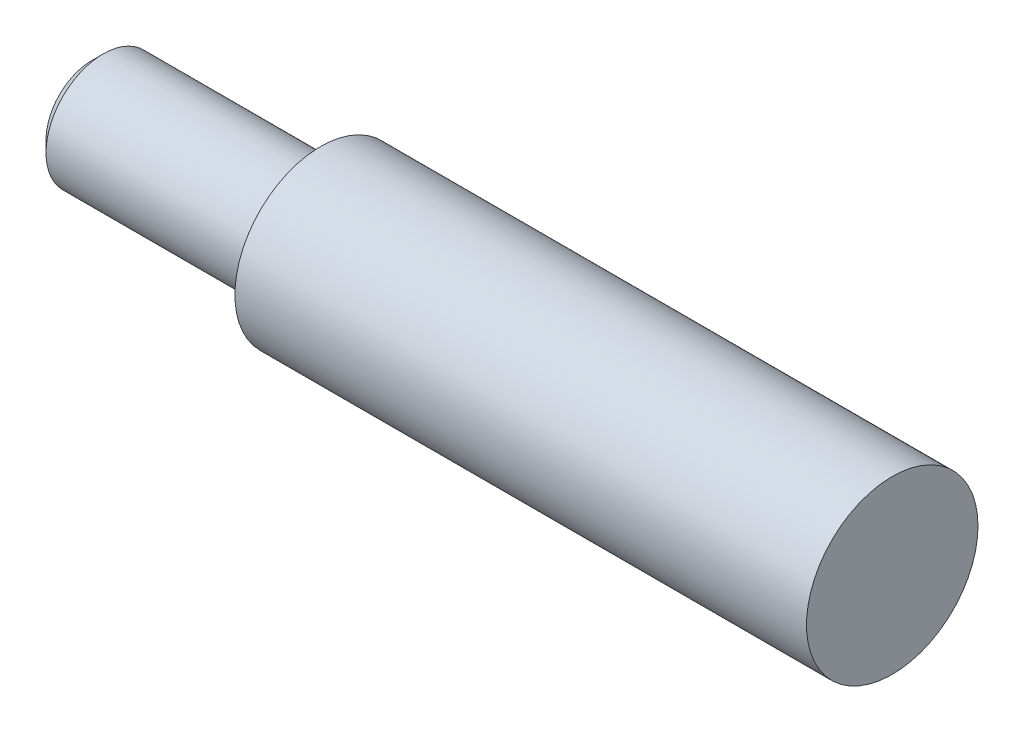
ISO-10303-21;
HEADER;
FILE_DESCRIPTION(('STEP AP214'),'2;1');
FILE_NAME('part.step','',(''),(''),'','','');
FILE_SCHEMA(('AUTOMOTIVE_DESIGN { 1 0 10303 214 1 1 1 1 }'));
ENDSEC;
DATA;
#1=APPLICATION_CONTEXT('core data for automotive mechanical design processes');
#2=APPLICATION_PROTOCOL_DEFINITION('international standard','automotive_design',2000,#1);
#3=PRODUCT_CONTEXT('',#1,'mechanical');
#4=PRODUCT('Part','Part','',(#3));
#5=PRODUCT_RELATED_PRODUCT_CATEGORY('part','',(#4));
#6=PRODUCT_DEFINITION_FORMATION('','',#4);
#7=PRODUCT_DEFINITION_CONTEXT('part definition',#1,'design');
#8=PRODUCT_DEFINITION('design','',#6,#7);
#9=PRODUCT_DEFINITION_SHAPE('','',#8);
#10=(LENGTH_UNIT() NAMED_UNIT(*) SI_UNIT(.MILLI.,.METRE.));
#11=(NAMED_UNIT(*) PLANE_ANGLE_UNIT() SI_UNIT($,.RADIAN.));
#12=(NAMED_UNIT(*) SI_UNIT($,.STERADIAN.) SOLID_ANGLE_UNIT());
#13=UNCERTAINTY_MEASURE_WITH_UNIT(LENGTH_MEASURE(1.E-05),#10,'distance_accuracy_value','');
#14=(GEOMETRIC_REPRESENTATION_CONTEXT(3) GLOBAL_UNCERTAINTY_ASSIGNED_CONTEXT((#13)) GLOBAL_UNIT_ASSIGNED_CONTEXT((#10,
#11,#12)) REPRESENTATION_CONTEXT('',''));
#15=CARTESIAN_POINT('',(0.,0.,0.));
#16=DIRECTION('',(0.,0.,1.));
#17=DIRECTION('',(1.,0.,0.));
#18=AXIS2_PLACEMENT_3D('',#15,#16,#17);
#19=CARTESIAN_POINT('',(8.,2.5,0.));
#20=DIRECTION('',(-1.,0.,0.));
#21=DIRECTION('',(0.,0.,1.));
#22=AXIS2_PLACEMENT_3D('',#19,#20,#21);
#23=PLANE('',#22);
#24=CARTESIAN_POINT('',(8.,0.,0.));
#25=DIRECTION('',(1.,0.,0.));
#26=DIRECTION('',(0.,0.,-1.));
#27=AXIS2_PLACEMENT_3D('',#24,#25,#26);
#28=CIRCLE('',#27,3.);
#29=CARTESIAN_POINT('',(8.,0.,-3.));
#30=VERTEX_POINT('',#29);
#31=EDGE_CURVE('E10',#30,#30,#28,.T.);
#32=ORIENTED_EDGE('',*,*,#31,.F.);
#33=EDGE_LOOP('',(#32));
#34=FACE_BOUND('',#33,.T.);
#35=CARTESIAN_POINT('',(8.,0.,0.));
#36=DIRECTION('',(1.,0.,0.));
#37=DIRECTION('',(0.,0.,-1.));
#38=AXIS2_PLACEMENT_3D('',#35,#36,#37);
#39=CIRCLE('',#38,2.);
#40=CARTESIAN_POINT('',(8.,0.,-2.));
#41=VERTEX_POINT('',#40);
#42=EDGE_CURVE('E54',#41,#41,#39,.T.);
#43=ORIENTED_EDGE('',*,*,#42,.T.);
#44=EDGE_LOOP('',(#43));
#45=FACE_BOUND('',#44,.T.);
#46=ADVANCED_FACE('F41',(#34,#45),#23,.T.);
#47=CARTESIAN_POINT('',(28.,0.,0.));
#48=DIRECTION('',(1.,0.,0.));
#49=DIRECTION('',(0.,0.,-1.));
#50=AXIS2_PLACEMENT_3D('',#47,#48,#49);
#51=CYLINDRICAL_SURFACE('',#50,3.);
#52=ORIENTED_EDGE('',*,*,#31,.T.);
#53=EDGE_LOOP('',(#52));
#54=FACE_BOUND('',#53,.T.);
#55=CARTESIAN_POINT('',(28.,0.,0.));
#56=DIRECTION('',(1.,0.,0.));
#57=DIRECTION('',(0.,0.,-1.));
#58=AXIS2_PLACEMENT_3D('',#55,#56,#57);
#59=CIRCLE('',#58,3.);
#60=CARTESIAN_POINT('',(28.,0.,-3.));
#61=VERTEX_POINT('',#60);
#62=EDGE_CURVE('E49',#61,#61,#59,.T.);
#63=ORIENTED_EDGE('',*,*,#62,.F.);
#64=EDGE_LOOP('',(#63));
#65=FACE_BOUND('',#64,.T.);
#66=ADVANCED_FACE('F82',(#54,#65),#51,.T.);
#67=CARTESIAN_POINT('',(28.,3.,0.));
#68=DIRECTION('',(1.,0.,0.));
#69=DIRECTION('',(0.,0.,-1.));
#70=AXIS2_PLACEMENT_3D('',#67,#68,#69);
#71=PLANE('',#70);
#72=ORIENTED_EDGE('',*,*,#62,.T.);
#73=EDGE_LOOP('',(#72));
#74=FACE_BOUND('',#73,.T.);
#75=ADVANCED_FACE('F87',(#74),#71,.T.);
#76=CARTESIAN_POINT('',(0.,0.,0.));
#77=DIRECTION('',(1.,0.,0.));
#78=DIRECTION('',(0.,0.,-1.));
#79=AXIS2_PLACEMENT_3D('',#76,#77,#78);
#80=CYLINDRICAL_SURFACE('',#79,2.);
#81=ORIENTED_EDGE('',*,*,#42,.F.);
#82=EDGE_LOOP('',(#81));
#83=FACE_BOUND('',#82,.T.);
#84=CARTESIAN_POINT('',(0.389999999999999,0.,0.));
#85=DIRECTION('',(1.,0.,0.));
#86=DIRECTION('',(0.,0.,-1.));
#87=AXIS2_PLACEMENT_3D('',#84,#85,#86);
#88=CIRCLE('',#87,2.);
#89=CARTESIAN_POINT('',(0.389999999999999,0.,-2.));
#90=VERTEX_POINT('',#89);
#91=EDGE_CURVE('E65',#90,#90,#88,.T.);
#92=ORIENTED_EDGE('',*,*,#91,.T.);
#93=EDGE_LOOP('',(#92));
#94=FACE_BOUND('',#93,.T.);
#95=ADVANCED_FACE('F70',(#83,#94),#80,.T.);
#96=CARTESIAN_POINT('',(0.,0.,0.));
#97=DIRECTION('',(1.,0.,0.));
#98=DIRECTION('',(0.,0.,-1.));
#99=AXIS2_PLACEMENT_3D('',#96,#97,#98);
#100=CONICAL_SURFACE('',#99,1.61,0.785398163397449);
#101=ORIENTED_EDGE('',*,*,#91,.F.);
#102=EDGE_LOOP('',(#101));
#103=FACE_BOUND('',#102,.T.);
#104=CARTESIAN_POINT('',(0.,0.,0.));
#105=DIRECTION('',(1.,0.,0.));
#106=DIRECTION('',(0.,0.,-1.));
#107=AXIS2_PLACEMENT_3D('',#104,#105,#106);
#108=CIRCLE('',#107,1.61);
#109=CARTESIAN_POINT('',(0.,0.,-1.61));
#110=VERTEX_POINT('',#109);
#111=EDGE_CURVE('E59',#110,#110,#108,.T.);
#112=ORIENTED_EDGE('',*,*,#111,.T.);
#113=EDGE_LOOP('',(#112));
#114=FACE_BOUND('',#113,.T.);
#115=ADVANCED_FACE('F72',(#103,#114),#100,.T.);
#116=CARTESIAN_POINT('',(0.,0.,0.));
#117=DIRECTION('',(-1.,0.,0.));
#118=DIRECTION('',(0.,0.,1.));
#119=AXIS2_PLACEMENT_3D('',#116,#117,#118);
#120=PLANE('',#119);
#121=ORIENTED_EDGE('',*,*,#111,.F.);
#122=EDGE_LOOP('',(#121));
#123=FACE_BOUND('',#122,.T.);
#124=ADVANCED_FACE('F43',(#123),#120,.T.);
#125=CLOSED_SHELL('',(#46,#66,#75,#95,#115,#124));
#126=MANIFOLD_SOLID_BREP('B2',#125);
#127=ADVANCED_BREP_SHAPE_REPRESENTATION('',(#18,#126),#14);
#128=SHAPE_DEFINITION_REPRESENTATION(#9,#127);
ENDSEC;
END-ISO-10303-21;
